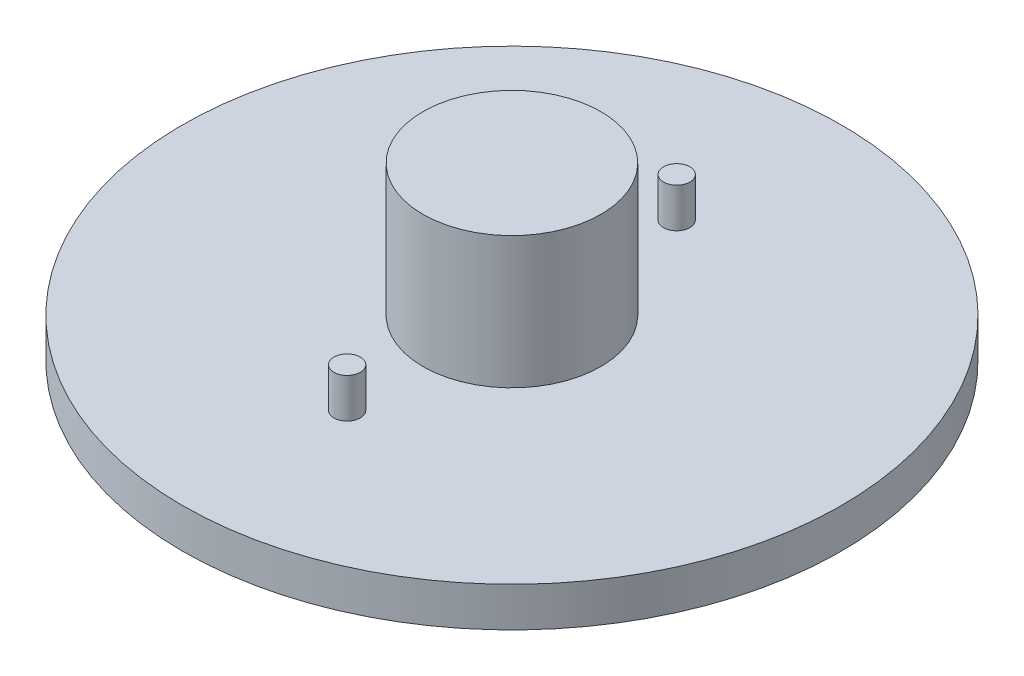
ISO-10303-21;
HEADER;
FILE_DESCRIPTION(('STEP AP214'),'2;1');
FILE_NAME('part.step','',(''),(''),'','','');
FILE_SCHEMA(('AUTOMOTIVE_DESIGN { 1 0 10303 214 1 1 1 1 }'));
ENDSEC;
DATA;
#1=APPLICATION_CONTEXT('core data for automotive mechanical design processes');
#2=APPLICATION_PROTOCOL_DEFINITION('international standard','automotive_design',2000,#1);
#3=PRODUCT_CONTEXT('',#1,'mechanical');
#4=PRODUCT('Part','Part','',(#3));
#5=PRODUCT_RELATED_PRODUCT_CATEGORY('part','',(#4));
#6=PRODUCT_DEFINITION_FORMATION('','',#4);
#7=PRODUCT_DEFINITION_CONTEXT('part definition',#1,'design');
#8=PRODUCT_DEFINITION('design','',#6,#7);
#9=PRODUCT_DEFINITION_SHAPE('','',#8);
#10=(LENGTH_UNIT() NAMED_UNIT(*) SI_UNIT(.MILLI.,.METRE.));
#11=(NAMED_UNIT(*) PLANE_ANGLE_UNIT() SI_UNIT($,.RADIAN.));
#12=(NAMED_UNIT(*) SI_UNIT($,.STERADIAN.) SOLID_ANGLE_UNIT());
#13=UNCERTAINTY_MEASURE_WITH_UNIT(LENGTH_MEASURE(1.E-05),#10,'distance_accuracy_value','');
#14=(GEOMETRIC_REPRESENTATION_CONTEXT(3) GLOBAL_UNCERTAINTY_ASSIGNED_CONTEXT((#13)) GLOBAL_UNIT_ASSIGNED_CONTEXT((#10,
#11,#12)) REPRESENTATION_CONTEXT('',''));
#15=CARTESIAN_POINT('',(0.,0.,0.));
#16=DIRECTION('',(0.,0.,1.));
#17=DIRECTION('',(1.,0.,0.));
#18=AXIS2_PLACEMENT_3D('',#15,#16,#17);
#19=CARTESIAN_POINT('',(35.881354138995,-1.27119809653265,0.));
#20=DIRECTION('',(0.,-1.,0.));
#21=DIRECTION('',(0.,0.,-1.));
#22=AXIS2_PLACEMENT_3D('',#19,#20,#21);
#23=PLANE('',#22);
#24=CARTESIAN_POINT('',(-14.118645861005,-1.27119809653265,25.));
#25=DIRECTION('',(0.,-1.,0.));
#26=DIRECTION('',(0.,0.,-1.));
#27=AXIS2_PLACEMENT_3D('',#24,#25,#26);
#28=CIRCLE('',#27,2.);
#29=CARTESIAN_POINT('',(-14.118645861005,-1.27119809653265,23.));
#30=VERTEX_POINT('',#29);
#31=EDGE_CURVE('E43',#30,#30,#28,.F.);
#32=ORIENTED_EDGE('',*,*,#31,.F.);
#33=EDGE_LOOP('',(#32));
#34=FACE_BOUND('',#33,.T.);
#35=CARTESIAN_POINT('',(-14.118645861005,-1.27119809653266,0.));
#36=DIRECTION('',(0.,1.,0.));
#37=DIRECTION('',(0.,0.,1.));
#38=AXIS2_PLACEMENT_3D('',#35,#36,#37);
#39=CIRCLE('',#38,13.5);
#40=CARTESIAN_POINT('',(-14.118645861005,-1.27119809653266,13.5));
#41=VERTEX_POINT('',#40);
#42=EDGE_CURVE('E86',#41,#41,#39,.T.);
#43=ORIENTED_EDGE('',*,*,#42,.F.);
#44=EDGE_LOOP('',(#43));
#45=FACE_BOUND('',#44,.T.);
#46=CARTESIAN_POINT('',(-14.118645861005,-1.27119809653265,0.));
#47=DIRECTION('',(0.,1.,0.));
#48=DIRECTION('',(0.,0.,1.));
#49=AXIS2_PLACEMENT_3D('',#46,#47,#48);
#50=CIRCLE('',#49,50.);
#51=CARTESIAN_POINT('',(-14.118645861005,-1.27119809653265,50.));
#52=VERTEX_POINT('',#51);
#53=EDGE_CURVE('E89',#52,#52,#50,.T.);
#54=ORIENTED_EDGE('',*,*,#53,.T.);
#55=EDGE_LOOP('',(#54));
#56=FACE_BOUND('',#55,.T.);
#57=CARTESIAN_POINT('',(-14.118645861005,-1.27119809653265,-25.));
#58=DIRECTION('',(0.,-1.,0.));
#59=DIRECTION('',(0.,0.,-1.));
#60=AXIS2_PLACEMENT_3D('',#57,#58,#59);
#61=CIRCLE('',#60,2.);
#62=CARTESIAN_POINT('',(-14.118645861005,-1.27119809653265,-27.));
#63=VERTEX_POINT('',#62);
#64=EDGE_CURVE('E11',#63,#63,#61,.F.);
#65=ORIENTED_EDGE('',*,*,#64,.F.);
#66=EDGE_LOOP('',(#65));
#67=FACE_BOUND('',#66,.T.);
#68=ADVANCED_FACE('F35',(#34,#45,#56,#67),#23,.F.);
#69=CARTESIAN_POINT('',(-14.118645861005,18.7288019034673,0.));
#70=DIRECTION('',(0.,1.,0.));
#71=DIRECTION('',(0.,0.,1.));
#72=AXIS2_PLACEMENT_3D('',#69,#70,#71);
#73=CYLINDRICAL_SURFACE('',#72,50.);
#74=ORIENTED_EDGE('',*,*,#53,.F.);
#75=EDGE_LOOP('',(#74));
#76=FACE_BOUND('',#75,.T.);
#77=CARTESIAN_POINT('',(-14.118645861005,-7.27119809653265,0.));
#78=DIRECTION('',(0.,1.,0.));
#79=DIRECTION('',(0.,0.,1.));
#80=AXIS2_PLACEMENT_3D('',#77,#78,#79);
#81=CIRCLE('',#80,50.);
#82=CARTESIAN_POINT('',(-14.118645861005,-7.27119809653265,50.));
#83=VERTEX_POINT('',#82);
#84=EDGE_CURVE('E75',#83,#83,#81,.T.);
#85=ORIENTED_EDGE('',*,*,#84,.T.);
#86=EDGE_LOOP('',(#85));
#87=FACE_BOUND('',#86,.T.);
#88=ADVANCED_FACE('F37',(#76,#87),#73,.T.);
#89=CARTESIAN_POINT('',(-14.118645861005,18.7288019034673,0.));
#90=DIRECTION('',(0.,1.,0.));
#91=DIRECTION('',(0.,0.,1.));
#92=AXIS2_PLACEMENT_3D('',#89,#90,#91);
#93=CYLINDRICAL_SURFACE('',#92,13.5);
#94=CARTESIAN_POINT('',(-14.118645861005,18.7288019034673,0.));
#95=DIRECTION('',(0.,1.,0.));
#96=DIRECTION('',(0.,0.,1.));
#97=AXIS2_PLACEMENT_3D('',#94,#95,#96);
#98=CIRCLE('',#97,13.5);
#99=CARTESIAN_POINT('',(-14.118645861005,18.7288019034673,13.5));
#100=VERTEX_POINT('',#99);
#101=EDGE_CURVE('E77',#100,#100,#98,.T.);
#102=ORIENTED_EDGE('',*,*,#101,.F.);
#103=EDGE_LOOP('',(#102));
#104=FACE_BOUND('',#103,.T.);
#105=ORIENTED_EDGE('',*,*,#42,.T.);
#106=EDGE_LOOP('',(#105));
#107=FACE_BOUND('',#106,.T.);
#108=ADVANCED_FACE('F136',(#104,#107),#93,.T.);
#109=CARTESIAN_POINT('',(-0.618645861005024,18.7288019034673,0.));
#110=DIRECTION('',(0.,-1.,0.));
#111=DIRECTION('',(0.,0.,-1.));
#112=AXIS2_PLACEMENT_3D('',#109,#110,#111);
#113=PLANE('',#112);
#114=ORIENTED_EDGE('',*,*,#101,.T.);
#115=EDGE_LOOP('',(#114));
#116=FACE_BOUND('',#115,.T.);
#117=ADVANCED_FACE('F132',(#116),#113,.F.);
#118=CARTESIAN_POINT('',(-14.118645861005,14.0816618978575,0.));
#119=DIRECTION('',(0.,1.,0.));
#120=DIRECTION('',(0.,0.,1.));
#121=AXIS2_PLACEMENT_3D('',#118,#119,#120);
#122=PLANE('',#121);
#123=CARTESIAN_POINT('',(-14.118645861005,14.0816618978575,0.));
#124=DIRECTION('',(0.,1.,0.));
#125=DIRECTION('',(0.,0.,1.));
#126=AXIS2_PLACEMENT_3D('',#123,#124,#125);
#127=CIRCLE('',#126,8.5);
#128=CARTESIAN_POINT('',(-7.61864586100502,14.0816618978575,-5.47722557505166));
#129=VERTEX_POINT('',#128);
#130=CARTESIAN_POINT('',(-7.61864586100502,14.0816618978575,5.47722557505166));
#131=VERTEX_POINT('',#130);
#132=EDGE_CURVE('E72',#129,#131,#127,.T.);
#133=ORIENTED_EDGE('',*,*,#132,.F.);
#134=DIRECTION('',(0.,0.,1.));
#135=VECTOR('',#134,1.);
#136=CARTESIAN_POINT('',(-7.61864586100502,14.0816618978575,0.));
#137=LINE('',#136,#135);
#138=EDGE_CURVE('E56',#129,#131,#137,.T.);
#139=ORIENTED_EDGE('',*,*,#138,.T.);
#140=EDGE_LOOP('',(#133,#139));
#141=FACE_BOUND('',#140,.T.);
#142=ADVANCED_FACE('F129',(#141),#122,.F.);
#143=CARTESIAN_POINT('',(-14.118645861005,18.7288019034673,0.));
#144=DIRECTION('',(0.,1.,0.));
#145=DIRECTION('',(0.,0.,1.));
#146=AXIS2_PLACEMENT_3D('',#143,#144,#145);
#147=CYLINDRICAL_SURFACE('',#146,8.5);
#148=ORIENTED_EDGE('',*,*,#132,.T.);
#149=DIRECTION('',(0.,-1.,0.));
#150=VECTOR('',#149,1.);
#151=CARTESIAN_POINT('',(-7.61864586100502,17.7288019034674,5.47722557505166));
#152=LINE('',#151,#150);
#153=CARTESIAN_POINT('',(-7.61864586100502,-7.27119809653265,5.47722557505166));
#154=VERTEX_POINT('',#153);
#155=EDGE_CURVE('E63',#131,#154,#152,.T.);
#156=ORIENTED_EDGE('',*,*,#155,.T.);
#157=CARTESIAN_POINT('',(-14.118645861005,-7.27119809653265,0.));
#158=DIRECTION('',(0.,1.,0.));
#159=DIRECTION('',(0.,0.,1.));
#160=AXIS2_PLACEMENT_3D('',#157,#158,#159);
#161=CIRCLE('',#160,8.5);
#162=CARTESIAN_POINT('',(-7.61864586100502,-7.27119809653265,-5.47722557505166));
#163=VERTEX_POINT('',#162);
#164=EDGE_CURVE('E70',#163,#154,#161,.T.);
#165=ORIENTED_EDGE('',*,*,#164,.F.);
#166=DIRECTION('',(0.,-1.,0.));
#167=VECTOR('',#166,1.);
#168=CARTESIAN_POINT('',(-7.61864586100502,17.7288019034674,-5.47722557505166));
#169=LINE('',#168,#167);
#170=EDGE_CURVE('E64',#129,#163,#169,.T.);
#171=ORIENTED_EDGE('',*,*,#170,.F.);
#172=EDGE_LOOP('',(#148,#156,#165,#171));
#173=FACE_BOUND('',#172,.T.);
#174=ADVANCED_FACE('F69',(#173),#147,.F.);
#175=CARTESIAN_POINT('',(-5.61864586100502,-7.27119809653265,0.));
#176=DIRECTION('',(0.,1.,0.));
#177=DIRECTION('',(0.,0.,1.));
#178=AXIS2_PLACEMENT_3D('',#175,#176,#177);
#179=PLANE('',#178);
#180=ORIENTED_EDGE('',*,*,#84,.F.);
#181=EDGE_LOOP('',(#180));
#182=FACE_BOUND('',#181,.T.);
#183=ORIENTED_EDGE('',*,*,#164,.T.);
#184=DIRECTION('',(0.,0.,-1.));
#185=VECTOR('',#184,1.);
#186=CARTESIAN_POINT('',(-7.61864586100502,-7.27119809653265,0.));
#187=LINE('',#186,#185);
#188=EDGE_CURVE('E49',#154,#163,#187,.T.);
#189=ORIENTED_EDGE('',*,*,#188,.T.);
#190=EDGE_LOOP('',(#183,#189));
#191=FACE_BOUND('',#190,.T.);
#192=ADVANCED_FACE('F74',(#182,#191),#179,.F.);
#193=CARTESIAN_POINT('',(-14.118645861005,4.72880190346735,25.));
#194=DIRECTION('',(0.,-1.,0.));
#195=DIRECTION('',(0.,0.,-1.));
#196=AXIS2_PLACEMENT_3D('',#193,#194,#195);
#197=CYLINDRICAL_SURFACE('',#196,2.);
#198=CARTESIAN_POINT('',(-14.118645861005,4.72880190346735,25.));
#199=DIRECTION('',(0.,1.,0.));
#200=DIRECTION('',(0.,0.,1.));
#201=AXIS2_PLACEMENT_3D('',#198,#199,#200);
#202=CIRCLE('',#201,2.);
#203=CARTESIAN_POINT('',(-14.118645861005,4.72880190346735,27.));
#204=VERTEX_POINT('',#203);
#205=EDGE_CURVE('E80',#204,#204,#202,.T.);
#206=ORIENTED_EDGE('',*,*,#205,.F.);
#207=EDGE_LOOP('',(#206));
#208=FACE_BOUND('',#207,.T.);
#209=ORIENTED_EDGE('',*,*,#31,.T.);
#210=EDGE_LOOP('',(#209));
#211=FACE_BOUND('',#210,.T.);
#212=ADVANCED_FACE('F94',(#208,#211),#197,.T.);
#213=CARTESIAN_POINT('',(-14.118645861005,4.72880190346735,25.));
#214=DIRECTION('',(0.,1.,0.));
#215=DIRECTION('',(0.,0.,1.));
#216=AXIS2_PLACEMENT_3D('',#213,#214,#215);
#217=PLANE('',#216);
#218=ORIENTED_EDGE('',*,*,#205,.T.);
#219=EDGE_LOOP('',(#218));
#220=FACE_BOUND('',#219,.T.);
#221=ADVANCED_FACE('F107',(#220),#217,.T.);
#222=CARTESIAN_POINT('',(-14.118645861005,4.72880190346735,-25.));
#223=DIRECTION('',(0.,-1.,0.));
#224=DIRECTION('',(0.,0.,-1.));
#225=AXIS2_PLACEMENT_3D('',#222,#223,#224);
#226=CYLINDRICAL_SURFACE('',#225,2.);
#227=CARTESIAN_POINT('',(-14.118645861005,4.72880190346735,-25.));
#228=DIRECTION('',(0.,1.,0.));
#229=DIRECTION('',(0.,0.,-1.));
#230=AXIS2_PLACEMENT_3D('',#227,#228,#229);
#231=CIRCLE('',#230,2.);
#232=CARTESIAN_POINT('',(-14.118645861005,4.72880190346735,-27.));
#233=VERTEX_POINT('',#232);
#234=EDGE_CURVE('E223',#233,#233,#231,.T.);
#235=ORIENTED_EDGE('',*,*,#234,.F.);
#236=EDGE_LOOP('',(#235));
#237=FACE_BOUND('',#236,.T.);
#238=ORIENTED_EDGE('',*,*,#64,.T.);
#239=EDGE_LOOP('',(#238));
#240=FACE_BOUND('',#239,.T.);
#241=ADVANCED_FACE('F104',(#237,#240),#226,.T.);
#242=CARTESIAN_POINT('',(-14.118645861005,4.72880190346735,-25.));
#243=DIRECTION('',(0.,-1.,0.));
#244=DIRECTION('',(0.,0.,-1.));
#245=AXIS2_PLACEMENT_3D('',#242,#243,#244);
#246=PLANE('',#245);
#247=ORIENTED_EDGE('',*,*,#234,.T.);
#248=EDGE_LOOP('',(#247));
#249=FACE_BOUND('',#248,.T.);
#250=ADVANCED_FACE('F106',(#249),#246,.F.);
#251=CARTESIAN_POINT('',(-7.61864586100502,17.7288019034674,0.));
#252=DIRECTION('',(-1.,0.,0.));
#253=DIRECTION('',(0.,0.,1.));
#254=AXIS2_PLACEMENT_3D('',#251,#252,#253);
#255=PLANE('',#254);
#256=ORIENTED_EDGE('',*,*,#138,.F.);
#257=ORIENTED_EDGE('',*,*,#170,.T.);
#258=ORIENTED_EDGE('',*,*,#188,.F.);
#259=ORIENTED_EDGE('',*,*,#155,.F.);
#260=EDGE_LOOP('',(#256,#257,#258,#259));
#261=FACE_BOUND('',#260,.T.);
#262=ADVANCED_FACE('F62',(#261),#255,.T.);
#263=CLOSED_SHELL('',(#68,#88,#108,#117,#142,#174,#192,#212,#221,#241,#250,#262));
#264=MANIFOLD_SOLID_BREP('B2',#263);
#265=ADVANCED_BREP_SHAPE_REPRESENTATION('',(#18,#264),#14);
#266=SHAPE_DEFINITION_REPRESENTATION(#9,#265);
ENDSEC;
END-ISO-10303-21;
